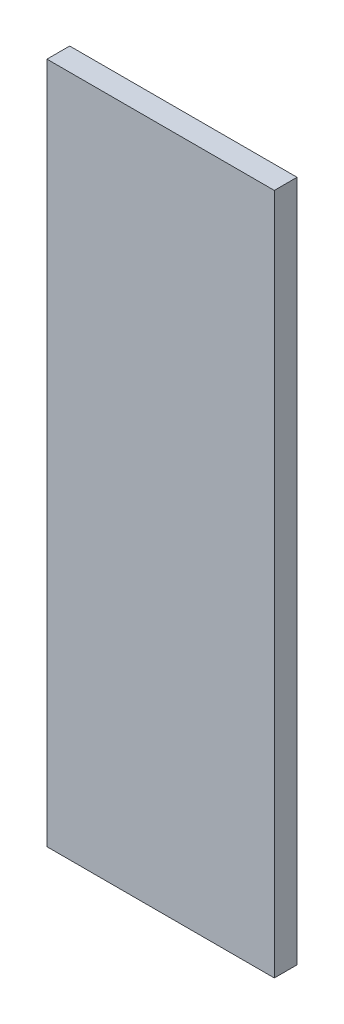
ISO-10303-21;
HEADER;
FILE_DESCRIPTION(('STEP AP214'),'2;1');
FILE_NAME('part.step','',(''),(''),'','','');
FILE_SCHEMA(('AUTOMOTIVE_DESIGN { 1 0 10303 214 1 1 1 1 }'));
ENDSEC;
DATA;
#1=APPLICATION_CONTEXT('core data for automotive mechanical design processes');
#2=APPLICATION_PROTOCOL_DEFINITION('international standard','automotive_design',2000,#1);
#3=PRODUCT_CONTEXT('',#1,'mechanical');
#4=PRODUCT('Part','Part','',(#3));
#5=PRODUCT_RELATED_PRODUCT_CATEGORY('part','',(#4));
#6=PRODUCT_DEFINITION_FORMATION('','',#4);
#7=PRODUCT_DEFINITION_CONTEXT('part definition',#1,'design');
#8=PRODUCT_DEFINITION('design','',#6,#7);
#9=PRODUCT_DEFINITION_SHAPE('','',#8);
#10=(LENGTH_UNIT() NAMED_UNIT(*) SI_UNIT(.MILLI.,.METRE.));
#11=(NAMED_UNIT(*) PLANE_ANGLE_UNIT() SI_UNIT($,.RADIAN.));
#12=(NAMED_UNIT(*) SI_UNIT($,.STERADIAN.) SOLID_ANGLE_UNIT());
#13=UNCERTAINTY_MEASURE_WITH_UNIT(LENGTH_MEASURE(1.E-05),#10,'distance_accuracy_value','');
#14=(GEOMETRIC_REPRESENTATION_CONTEXT(3) GLOBAL_UNCERTAINTY_ASSIGNED_CONTEXT((#13)) GLOBAL_UNIT_ASSIGNED_CONTEXT((#10,
#11,#12)) REPRESENTATION_CONTEXT('',''));
#15=CARTESIAN_POINT('',(0.,0.,0.));
#16=DIRECTION('',(0.,0.,1.));
#17=DIRECTION('',(1.,0.,0.));
#18=AXIS2_PLACEMENT_3D('',#15,#16,#17);
#19=CARTESIAN_POINT('',(5.,15.,1.));
#20=DIRECTION('',(-1.,0.,0.));
#21=DIRECTION('',(0.,-1.,0.));
#22=AXIS2_PLACEMENT_3D('',#19,#20,#21);
#23=PLANE('',#22);
#24=DIRECTION('',(0.,1.,0.));
#25=VECTOR('',#24,1.);
#26=CARTESIAN_POINT('',(5.,15.,0.));
#27=LINE('',#26,#25);
#28=CARTESIAN_POINT('',(5.,-15.,0.));
#29=VERTEX_POINT('',#28);
#30=CARTESIAN_POINT('',(5.,15.,0.));
#31=VERTEX_POINT('',#30);
#32=EDGE_CURVE('E109',#29,#31,#27,.T.);
#33=ORIENTED_EDGE('',*,*,#32,.T.);
#34=DIRECTION('',(0.,0.,-1.));
#35=VECTOR('',#34,1.);
#36=CARTESIAN_POINT('',(5.,15.,1.));
#37=LINE('',#36,#35);
#38=CARTESIAN_POINT('',(5.,15.,1.));
#39=VERTEX_POINT('',#38);
#40=EDGE_CURVE('E11',#39,#31,#37,.T.);
#41=ORIENTED_EDGE('',*,*,#40,.F.);
#42=DIRECTION('',(0.,1.,0.));
#43=VECTOR('',#42,1.);
#44=CARTESIAN_POINT('',(5.,15.,1.));
#45=LINE('',#44,#43);
#46=CARTESIAN_POINT('',(5.,-15.,1.));
#47=VERTEX_POINT('',#46);
#48=EDGE_CURVE('E93',#47,#39,#45,.T.);
#49=ORIENTED_EDGE('',*,*,#48,.F.);
#50=DIRECTION('',(0.,0.,-1.));
#51=VECTOR('',#50,1.);
#52=CARTESIAN_POINT('',(5.,-15.,1.));
#53=LINE('',#52,#51);
#54=EDGE_CURVE('E105',#47,#29,#53,.T.);
#55=ORIENTED_EDGE('',*,*,#54,.T.);
#56=EDGE_LOOP('',(#33,#41,#49,#55));
#57=FACE_BOUND('',#56,.T.);
#58=ADVANCED_FACE('F41',(#57),#23,.F.);
#59=CARTESIAN_POINT('',(-5.,15.,1.));
#60=DIRECTION('',(0.,-1.,0.));
#61=DIRECTION('',(0.,0.,-1.));
#62=AXIS2_PLACEMENT_3D('',#59,#60,#61);
#63=PLANE('',#62);
#64=DIRECTION('',(-1.,0.,0.));
#65=VECTOR('',#64,1.);
#66=CARTESIAN_POINT('',(-5.,15.,0.));
#67=LINE('',#66,#65);
#68=CARTESIAN_POINT('',(-5.,15.,0.));
#69=VERTEX_POINT('',#68);
#70=EDGE_CURVE('E98',#31,#69,#67,.T.);
#71=ORIENTED_EDGE('',*,*,#70,.T.);
#72=DIRECTION('',(0.,0.,-1.));
#73=VECTOR('',#72,1.);
#74=CARTESIAN_POINT('',(-5.,15.,1.));
#75=LINE('',#74,#73);
#76=CARTESIAN_POINT('',(-5.,15.,1.));
#77=VERTEX_POINT('',#76);
#78=EDGE_CURVE('E50',#77,#69,#75,.T.);
#79=ORIENTED_EDGE('',*,*,#78,.F.);
#80=DIRECTION('',(-1.,0.,0.));
#81=VECTOR('',#80,1.);
#82=CARTESIAN_POINT('',(-5.,15.,1.));
#83=LINE('',#82,#81);
#84=EDGE_CURVE('E88',#39,#77,#83,.T.);
#85=ORIENTED_EDGE('',*,*,#84,.F.);
#86=ORIENTED_EDGE('',*,*,#40,.T.);
#87=EDGE_LOOP('',(#71,#79,#85,#86));
#88=FACE_BOUND('',#87,.T.);
#89=ADVANCED_FACE('F97',(#88),#63,.F.);
#90=CARTESIAN_POINT('',(-5.,15.,1.));
#91=DIRECTION('',(1.,0.,0.));
#92=DIRECTION('',(0.,1.,0.));
#93=AXIS2_PLACEMENT_3D('',#90,#91,#92);
#94=PLANE('',#93);
#95=DIRECTION('',(0.,-1.,0.));
#96=VECTOR('',#95,1.);
#97=CARTESIAN_POINT('',(-5.,15.,0.));
#98=LINE('',#97,#96);
#99=CARTESIAN_POINT('',(-5.,-15.,0.));
#100=VERTEX_POINT('',#99);
#101=EDGE_CURVE('E75',#69,#100,#98,.T.);
#102=ORIENTED_EDGE('',*,*,#101,.T.);
#103=DIRECTION('',(0.,0.,-1.));
#104=VECTOR('',#103,1.);
#105=CARTESIAN_POINT('',(-5.,-15.,1.));
#106=LINE('',#105,#104);
#107=CARTESIAN_POINT('',(-5.,-15.,1.));
#108=VERTEX_POINT('',#107);
#109=EDGE_CURVE('E100',#108,#100,#106,.T.);
#110=ORIENTED_EDGE('',*,*,#109,.F.);
#111=DIRECTION('',(0.,-1.,0.));
#112=VECTOR('',#111,1.);
#113=CARTESIAN_POINT('',(-5.,15.,1.));
#114=LINE('',#113,#112);
#115=EDGE_CURVE('E91',#77,#108,#114,.T.);
#116=ORIENTED_EDGE('',*,*,#115,.F.);
#117=ORIENTED_EDGE('',*,*,#78,.T.);
#118=EDGE_LOOP('',(#102,#110,#116,#117));
#119=FACE_BOUND('',#118,.T.);
#120=ADVANCED_FACE('F101',(#119),#94,.F.);
#121=CARTESIAN_POINT('',(-5.,-15.,1.));
#122=DIRECTION('',(0.,1.,0.));
#123=DIRECTION('',(0.,0.,1.));
#124=AXIS2_PLACEMENT_3D('',#121,#122,#123);
#125=PLANE('',#124);
#126=DIRECTION('',(1.,0.,0.));
#127=VECTOR('',#126,1.);
#128=CARTESIAN_POINT('',(-5.,-15.,0.));
#129=LINE('',#128,#127);
#130=EDGE_CURVE('E81',#100,#29,#129,.T.);
#131=ORIENTED_EDGE('',*,*,#130,.T.);
#132=ORIENTED_EDGE('',*,*,#54,.F.);
#133=DIRECTION('',(1.,0.,0.));
#134=VECTOR('',#133,1.);
#135=CARTESIAN_POINT('',(-5.,-15.,1.));
#136=LINE('',#135,#134);
#137=EDGE_CURVE('E58',#108,#47,#136,.T.);
#138=ORIENTED_EDGE('',*,*,#137,.F.);
#139=ORIENTED_EDGE('',*,*,#109,.T.);
#140=EDGE_LOOP('',(#131,#132,#138,#139));
#141=FACE_BOUND('',#140,.T.);
#142=ADVANCED_FACE('F122',(#141),#125,.F.);
#143=CARTESIAN_POINT('',(0.,0.,1.));
#144=DIRECTION('',(0.,0.,1.));
#145=DIRECTION('',(1.,0.,0.));
#146=AXIS2_PLACEMENT_3D('',#143,#144,#145);
#147=PLANE('',#146);
#148=ORIENTED_EDGE('',*,*,#48,.T.);
#149=ORIENTED_EDGE('',*,*,#84,.T.);
#150=ORIENTED_EDGE('',*,*,#115,.T.);
#151=ORIENTED_EDGE('',*,*,#137,.T.);
#152=EDGE_LOOP('',(#148,#149,#150,#151));
#153=FACE_BOUND('',#152,.T.);
#154=ADVANCED_FACE('F89',(#153),#147,.T.);
#155=CARTESIAN_POINT('',(0.,0.,0.));
#156=DIRECTION('',(0.,0.,1.));
#157=DIRECTION('',(1.,0.,0.));
#158=AXIS2_PLACEMENT_3D('',#155,#156,#157);
#159=PLANE('',#158);
#160=ORIENTED_EDGE('',*,*,#32,.F.);
#161=ORIENTED_EDGE('',*,*,#130,.F.);
#162=ORIENTED_EDGE('',*,*,#101,.F.);
#163=ORIENTED_EDGE('',*,*,#70,.F.);
#164=EDGE_LOOP('',(#160,#161,#162,#163));
#165=FACE_BOUND('',#164,.T.);
#166=ADVANCED_FACE('F125',(#165),#159,.F.);
#167=CLOSED_SHELL('',(#58,#89,#120,#142,#154,#166));
#168=MANIFOLD_SOLID_BREP('B2',#167);
#169=ADVANCED_BREP_SHAPE_REPRESENTATION('',(#18,#168),#14);
#170=SHAPE_DEFINITION_REPRESENTATION(#9,#169);
ENDSEC;
END-ISO-10303-21;
